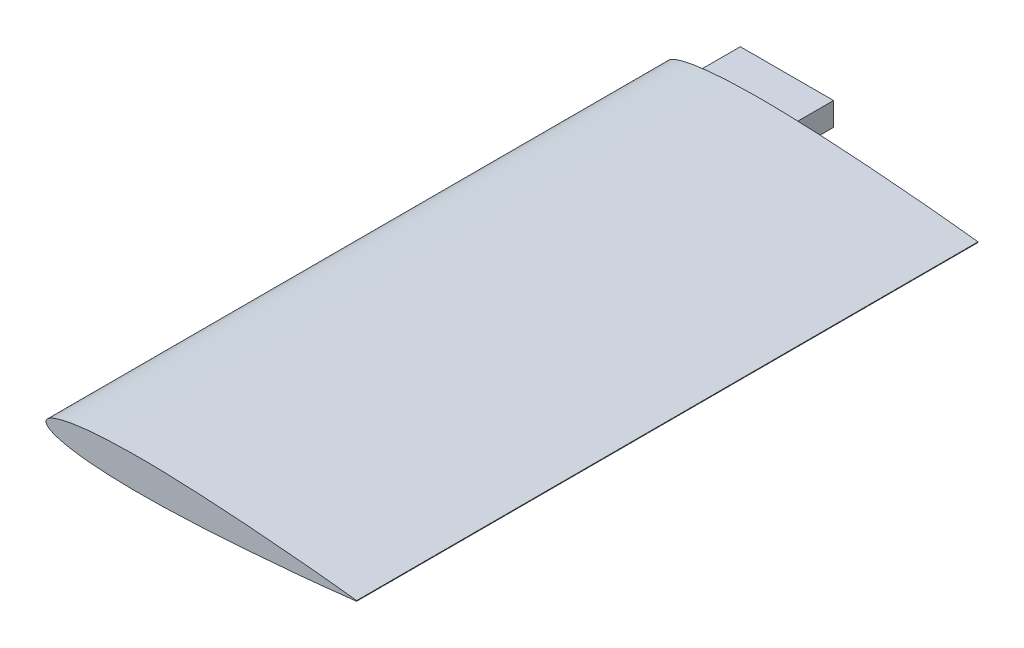
ISO-10303-21;
HEADER;
FILE_DESCRIPTION(('STEP AP214'),'2;1');
FILE_NAME('part.step','',(''),(''),'','','');
FILE_SCHEMA(('AUTOMOTIVE_DESIGN { 1 0 10303 214 1 1 1 1 }'));
ENDSEC;
DATA;
#1=APPLICATION_CONTEXT('core data for automotive mechanical design processes');
#2=APPLICATION_PROTOCOL_DEFINITION('international standard','automotive_design',2000,#1);
#3=PRODUCT_CONTEXT('',#1,'mechanical');
#4=PRODUCT('Part','Part','',(#3));
#5=PRODUCT_RELATED_PRODUCT_CATEGORY('part','',(#4));
#6=PRODUCT_DEFINITION_FORMATION('','',#4);
#7=PRODUCT_DEFINITION_CONTEXT('part definition',#1,'design');
#8=PRODUCT_DEFINITION('design','',#6,#7);
#9=PRODUCT_DEFINITION_SHAPE('','',#8);
#10=(LENGTH_UNIT() NAMED_UNIT(*) SI_UNIT(.MILLI.,.METRE.));
#11=(NAMED_UNIT(*) PLANE_ANGLE_UNIT() SI_UNIT($,.RADIAN.));
#12=(NAMED_UNIT(*) SI_UNIT($,.STERADIAN.) SOLID_ANGLE_UNIT());
#13=UNCERTAINTY_MEASURE_WITH_UNIT(LENGTH_MEASURE(1.E-05),#10,'distance_accuracy_value','');
#14=(GEOMETRIC_REPRESENTATION_CONTEXT(3) GLOBAL_UNCERTAINTY_ASSIGNED_CONTEXT((#13)) GLOBAL_UNIT_ASSIGNED_CONTEXT((#10,
#11,#12)) REPRESENTATION_CONTEXT('',''));
#15=CARTESIAN_POINT('',(0.,0.,0.));
#16=DIRECTION('',(0.,0.,1.));
#17=DIRECTION('',(1.,0.,0.));
#18=AXIS2_PLACEMENT_3D('',#15,#16,#17);
#19=CARTESIAN_POINT('',(40.1321242567515,0.0535132591243339,76.2));
#20=CARTESIAN_POINT('',(40.1279418105788,0.0540050721144117,76.2));
#21=CARTESIAN_POINT('',(40.1112306810011,0.0559701304238156,76.2));
#22=CARTESIAN_POINT('',(40.0736500018208,0.0603077694182548,76.2));
#23=CARTESIAN_POINT('',(40.0110703708323,0.0676571969514773,76.2));
#24=CARTESIAN_POINT('',(39.9235418389783,0.0778500160790829,76.2));
#25=CARTESIAN_POINT('',(39.8111541599803,0.0908957827580396,76.2));
#26=CARTESIAN_POINT('',(39.6740134947025,0.106800014944156,76.2));
#27=CARTESIAN_POINT('',(39.5122696334025,0.125489705283019,76.2));
#28=CARTESIAN_POINT('',(39.326052008163,0.146861496618066,76.2));
#29=CARTESIAN_POINT('',(39.1155709032029,0.170925875928625,76.2));
#30=CARTESIAN_POINT('',(38.8810179946178,0.197663416361273,76.2));
#31=CARTESIAN_POINT('',(38.6226275821043,0.226832706619644,76.2));
#32=CARTESIAN_POINT('',(38.3406749949409,0.258537197320393,76.2));
#33=CARTESIAN_POINT('',(38.0354368307757,0.292609945815936,76.2));
#34=CARTESIAN_POINT('',(37.7071840307129,0.328965573786818,76.2));
#35=CARTESIAN_POINT('',(37.3562624930981,0.367568214027175,76.2));
#36=CARTESIAN_POINT('',(36.9830035756714,0.408250517254515,76.2));
#37=CARTESIAN_POINT('',(36.587790786723,0.450870894472311,76.2));
#38=CARTESIAN_POINT('',(36.1710239241677,0.495565525508571,76.2));
#39=CARTESIAN_POINT('',(35.7330703446121,0.541884830508245,76.2));
#40=CARTESIAN_POINT('',(35.2744157429119,0.5899763151425,76.2));
#41=CARTESIAN_POINT('',(34.7954986183052,0.639725376074922,76.2));
#42=CARTESIAN_POINT('',(34.2967751994489,0.690839822605708,76.2));
#43=CARTESIAN_POINT('',(33.7787145508828,0.743330728829342,76.2));
#44=CARTESIAN_POINT('',(33.2418710797798,0.797207444460088,76.2));
#45=CARTESIAN_POINT('',(32.6867547460175,0.852047913760495,76.2));
#46=CARTESIAN_POINT('',(32.1139436448372,0.908065938360405,76.2));
#47=CARTESIAN_POINT('',(31.5239610615497,0.964829907969942,76.2));
#48=CARTESIAN_POINT('',(30.9174205414204,1.02258034996911,76.2));
#49=CARTESIAN_POINT('',(30.2948930377771,1.08082656422309,76.2));
#50=CARTESIAN_POINT('',(29.6570219518069,1.13977524035605,76.2));
#51=CARTESIAN_POINT('',(29.004390809288,1.19906129287884,76.2));
#52=CARTESIAN_POINT('',(28.3376945314625,1.25874030326226,76.2));
#53=CARTESIAN_POINT('',(27.6575702384295,1.31862610858959,76.2));
#54=CARTESIAN_POINT('',(26.9646919851027,1.37854457465211,76.2));
#55=CARTESIAN_POINT('',(26.2597400034809,1.43840919419539,76.2));
#56=CARTESIAN_POINT('',(25.5434124542922,1.49814917729009,76.2));
#57=CARTESIAN_POINT('',(24.8164129624148,1.55755498997334,76.2));
#58=CARTESIAN_POINT('',(24.0794595530179,1.61657403866187,76.2));
#59=CARTESIAN_POINT('',(23.3332777452138,1.67504069757509,76.2));
#60=CARTESIAN_POINT('',(22.5786257333917,1.73276874566306,76.2));
#61=CARTESIAN_POINT('',(21.8162218953056,1.78971692888558,76.2));
#62=CARTESIAN_POINT('',(21.046840240567,1.84568618796407,76.2));
#63=CARTESIAN_POINT('',(20.2712084549513,1.90053260368886,76.2));
#64=CARTESIAN_POINT('',(19.4901089900151,1.95417086234081,76.2));
#65=CARTESIAN_POINT('',(18.7043206182456,2.00645040641639,76.2));
#66=CARTESIAN_POINT('',(17.9146000739347,2.05713873486335,76.2));
#67=CARTESIAN_POINT('',(17.1217459164428,2.1061363071151,76.2));
#68=CARTESIAN_POINT('',(16.3265273676357,2.15341725133557,76.2));
#69=CARTESIAN_POINT('',(15.5297440018734,2.19860638147546,76.2));
#70=CARTESIAN_POINT('',(14.7321842807355,2.24169620537655,76.2));
#71=CARTESIAN_POINT('',(13.9346236148725,2.28249179202487,76.2));
#72=CARTESIAN_POINT('',(13.1378418921401,2.32086093551415,76.2));
#73=CARTESIAN_POINT('',(12.3426155447534,2.3566094256444,76.2));
#74=CARTESIAN_POINT('',(11.5497643761831,2.38974081095151,76.2));
#75=CARTESIAN_POINT('',(10.7600377543389,2.41981778532476,76.2));
#76=CARTESIAN_POINT('',(9.97424744165448,2.44708366581708,76.2));
#77=CARTESIAN_POINT('',(9.19313934567928,2.47097534206958,76.2));
#78=CARTESIAN_POINT('',(8.41750418608583,2.49169597173862,76.2));
#79=CARTESIAN_POINT('',(7.64811567965739,2.50898985337273,76.2));
#80=CARTESIAN_POINT('',(6.88570301655792,2.52275829295624,76.2));
#81=CARTESIAN_POINT('',(6.13104339467506,2.53275444423582,76.2));
#82=CARTESIAN_POINT('',(5.38485105204477,2.53913164680119,76.2));
#83=CARTESIAN_POINT('',(4.64788512553625,2.54153799464248,76.2));
#84=CARTESIAN_POINT('',(3.92087514141403,2.54000731250512,76.2));
#85=CARTESIAN_POINT('',(3.20453219589683,2.53445020872994,76.2));
#86=CARTESIAN_POINT('',(2.49956553103827,2.52488481958942,76.2));
#87=CARTESIAN_POINT('',(1.80667307590379,2.51103486604574,76.2));
#88=CARTESIAN_POINT('',(1.12652852955934,2.49306760487807,76.2));
#89=CARTESIAN_POINT('',(0.459809878985288,2.47088592607632,76.2));
#90=CARTESIAN_POINT('',(-0.192838445901487,2.44443382966969,76.2));
#91=CARTESIAN_POINT('',(-0.830738428269239,2.41370818746878,76.2));
#92=CARTESIAN_POINT('',(-1.45328379873764,2.37878688734276,76.2));
#93=CARTESIAN_POINT('',(-2.05986417382781,2.33965635630447,76.2));
#94=CARTESIAN_POINT('',(-2.64986914419755,2.29631645942534,76.2));
#95=CARTESIAN_POINT('',(-3.22271949769868,2.24878538817981,76.2));
#96=CARTESIAN_POINT('',(-3.77786955569188,2.19725198261085,76.2));
#97=CARTESIAN_POINT('',(-4.3147597071102,2.14160909006856,76.2));
#98=CARTESIAN_POINT('',(-4.83286615753457,2.08209956747325,76.2));
#99=CARTESIAN_POINT('',(-5.33163777717199,2.0187267292494,76.2));
#100=CARTESIAN_POINT('',(-5.81062084975922,1.95160118572107,76.2));
#101=CARTESIAN_POINT('',(-6.26933866851263,1.88082151875277,76.2));
#102=CARTESIAN_POINT('',(-6.70736929256317,1.80658674829826,76.2));
#103=CARTESIAN_POINT('',(-7.12423437792924,1.72887793709155,76.2));
#104=CARTESIAN_POINT('',(-7.51954065509877,1.64788477248388,76.2));
#105=CARTESIAN_POINT('',(-7.89292670509431,1.56377392761245,76.2));
#106=CARTESIAN_POINT('',(-8.24400123777592,1.47664693629061,76.2));
#107=CARTESIAN_POINT('',(-8.57242018282951,1.38660576756098,76.2));
#108=CARTESIAN_POINT('',(-8.87788299174352,1.29389098278241,76.2));
#109=CARTESIAN_POINT('',(-9.16011072254911,1.19854663873041,76.2));
#110=CARTESIAN_POINT('',(-9.41882434926777,1.10068145098127,76.2));
#111=CARTESIAN_POINT('',(-9.65381471632782,1.000471331635,76.2));
#112=CARTESIAN_POINT('',(-9.86484204596546,0.897997360188644,76.2));
#113=CARTESIAN_POINT('',(-10.0517333555882,0.793330779378764,76.2));
#114=CARTESIAN_POINT('',(-10.2144396307485,0.686687292838309,76.2));
#115=CARTESIAN_POINT('',(-10.3527397509045,0.577857279629728,76.2));
#116=CARTESIAN_POINT('',(-10.4665950669418,0.466915986358584,76.2));
#117=CARTESIAN_POINT('',(-10.5558891163278,0.35374488731564,76.2));
#118=CARTESIAN_POINT('',(-10.6202773458401,0.238098542259817,76.2));
#119=CARTESIAN_POINT('',(-10.6592143401123,0.119945635455643,76.2));
#120=CARTESIAN_POINT('',(-10.6721398921472,0.000173259124337126,76.2));
#121=CARTESIAN_POINT('',(-10.6592143401123,-0.119599117206975,76.2));
#122=CARTESIAN_POINT('',(-10.6202773458401,-0.237752024011159,76.2));
#123=CARTESIAN_POINT('',(-10.5558891163278,-0.353398369066962,76.2));
#124=CARTESIAN_POINT('',(-10.4665950669418,-0.466569468109921,76.2));
#125=CARTESIAN_POINT('',(-10.3527397509045,-0.57751076138106,76.2));
#126=CARTESIAN_POINT('',(-10.2144396307485,-0.686340774589639,76.2));
#127=CARTESIAN_POINT('',(-10.0517333555882,-0.792984261130103,76.2));
#128=CARTESIAN_POINT('',(-9.86484204596547,-0.89765084193997,76.2));
#129=CARTESIAN_POINT('',(-9.65381471632782,-1.00012481338633,76.2));
#130=CARTESIAN_POINT('',(-9.41882434926777,-1.1003349327326,76.2));
#131=CARTESIAN_POINT('',(-9.16011072254912,-1.19820012048174,76.2));
#132=CARTESIAN_POINT('',(-8.87788299174351,-1.29354446453374,76.2));
#133=CARTESIAN_POINT('',(-8.57242018282952,-1.38625924931231,76.2));
#134=CARTESIAN_POINT('',(-8.24400123777591,-1.47630041804194,76.2));
#135=CARTESIAN_POINT('',(-7.89292670509432,-1.56342740936378,76.2));
#136=CARTESIAN_POINT('',(-7.51954065509876,-1.64753825423521,76.2));
#137=CARTESIAN_POINT('',(-7.12423437792925,-1.72853141884288,76.2));
#138=CARTESIAN_POINT('',(-6.70736929256316,-1.80624023004959,76.2));
#139=CARTESIAN_POINT('',(-6.26933866851263,-1.8804750005041,76.2));
#140=CARTESIAN_POINT('',(-5.81062084975922,-1.9512546674724,76.2));
#141=CARTESIAN_POINT('',(-5.33163777717199,-2.01838021100073,76.2));
#142=CARTESIAN_POINT('',(-4.83286615753458,-2.08175304922458,76.2));
#143=CARTESIAN_POINT('',(-4.31475970711019,-2.14126257181989,76.2));
#144=CARTESIAN_POINT('',(-3.77786955569188,-2.19690546436219,76.2));
#145=CARTESIAN_POINT('',(-3.22271949769869,-2.24843886993114,76.2));
#146=CARTESIAN_POINT('',(-2.64986914419754,-2.29596994117668,76.2));
#147=CARTESIAN_POINT('',(-2.05986417382782,-2.3393098380558,76.2));
#148=CARTESIAN_POINT('',(-1.45328379873763,-2.37844036909409,76.2));
#149=CARTESIAN_POINT('',(-0.830738428269235,-2.41336166922011,76.2));
#150=CARTESIAN_POINT('',(-0.192838445901483,-2.44408731142102,76.2));
#151=CARTESIAN_POINT('',(0.459809878985286,-2.47053940782765,76.2));
#152=CARTESIAN_POINT('',(1.12652852955934,-2.4927210866294,76.2));
#153=CARTESIAN_POINT('',(1.80667307590379,-2.51068834779707,76.2));
#154=CARTESIAN_POINT('',(2.49956553103827,-2.52453830134076,76.2));
#155=CARTESIAN_POINT('',(3.20453219589683,-2.53410369048127,76.2));
#156=CARTESIAN_POINT('',(3.92087514141403,-2.53966079425645,76.2));
#157=CARTESIAN_POINT('',(4.64788512553625,-2.54119147639381,76.2));
#158=CARTESIAN_POINT('',(5.38485105204477,-2.53878512855252,76.2));
#159=CARTESIAN_POINT('',(6.13104339467506,-2.53240792598715,76.2));
#160=CARTESIAN_POINT('',(6.88570301655792,-2.52241177470757,76.2));
#161=CARTESIAN_POINT('',(7.6481156796574,-2.50864333512407,76.2));
#162=CARTESIAN_POINT('',(8.41750418608584,-2.49134945348995,76.2));
#163=CARTESIAN_POINT('',(9.19313934567927,-2.47062882382092,76.2));
#164=CARTESIAN_POINT('',(9.97424744165448,-2.44673714756841,76.2));
#165=CARTESIAN_POINT('',(10.7600377543389,-2.41947126707609,76.2));
#166=CARTESIAN_POINT('',(11.5497643761831,-2.38939429270284,76.2));
#167=CARTESIAN_POINT('',(12.3426155447534,-2.35626290739573,76.2));
#168=CARTESIAN_POINT('',(13.1378418921401,-2.32051441726548,76.2));
#169=CARTESIAN_POINT('',(13.9346236148725,-2.2821452737762,76.2));
#170=CARTESIAN_POINT('',(14.7321842807355,-2.24134968712788,76.2));
#171=CARTESIAN_POINT('',(15.5297440018734,-2.19825986322679,76.2));
#172=CARTESIAN_POINT('',(16.3265273676357,-2.1530707330869,76.2));
#173=CARTESIAN_POINT('',(17.1217459164429,-2.10578978886643,76.2));
#174=CARTESIAN_POINT('',(17.9146000739347,-2.05679221661469,76.2));
#175=CARTESIAN_POINT('',(18.7043206182456,-2.00610388816772,76.2));
#176=CARTESIAN_POINT('',(19.4901089900151,-1.95382434409214,76.2));
#177=CARTESIAN_POINT('',(20.2712084549513,-1.9001860854402,76.2));
#178=CARTESIAN_POINT('',(21.046840240567,-1.8453396697154,76.2));
#179=CARTESIAN_POINT('',(21.8162218953056,-1.78937041063691,76.2));
#180=CARTESIAN_POINT('',(22.5786257333917,-1.73242222741439,76.2));
#181=CARTESIAN_POINT('',(23.3332777452138,-1.67469417932642,76.2));
#182=CARTESIAN_POINT('',(24.0794595530179,-1.61622752041321,76.2));
#183=CARTESIAN_POINT('',(24.8164129624148,-1.55720847172467,76.2));
#184=CARTESIAN_POINT('',(25.5434124542922,-1.49780265904142,76.2));
#185=CARTESIAN_POINT('',(26.2597400034809,-1.43806267594672,76.2));
#186=CARTESIAN_POINT('',(26.9646919851027,-1.37819805640344,76.2));
#187=CARTESIAN_POINT('',(27.6575702384295,-1.31827959034092,76.2));
#188=CARTESIAN_POINT('',(28.3376945314625,-1.25839378501359,76.2));
#189=CARTESIAN_POINT('',(29.004390809288,-1.19871477463017,76.2));
#190=CARTESIAN_POINT('',(29.6570219518069,-1.13942872210738,76.2));
#191=CARTESIAN_POINT('',(30.2948930377771,-1.08048004597442,76.2));
#192=CARTESIAN_POINT('',(30.9174205414204,-1.02223383172044,76.2));
#193=CARTESIAN_POINT('',(31.5239610615497,-0.964483389721274,76.2));
#194=CARTESIAN_POINT('',(32.1139436448372,-0.907719420111737,76.2));
#195=CARTESIAN_POINT('',(32.6867547460175,-0.851701395511828,76.2));
#196=CARTESIAN_POINT('',(33.2418710797798,-0.79686092621142,76.2));
#197=CARTESIAN_POINT('',(33.7787145508828,-0.742984210580674,76.2));
#198=CARTESIAN_POINT('',(34.296775199449,-0.690493304357041,76.2));
#199=CARTESIAN_POINT('',(34.7954986183052,-0.639378857826254,76.2));
#200=CARTESIAN_POINT('',(35.2744157429119,-0.589629796893832,76.2));
#201=CARTESIAN_POINT('',(35.7330703446121,-0.541538312259577,76.2));
#202=CARTESIAN_POINT('',(36.1710239241677,-0.495219007259902,76.2));
#203=CARTESIAN_POINT('',(36.587790786723,-0.450524376223643,76.2));
#204=CARTESIAN_POINT('',(36.9830035756714,-0.407903999005847,76.2));
#205=CARTESIAN_POINT('',(37.3562624930981,-0.367221695778506,76.2));
#206=CARTESIAN_POINT('',(37.7071840307129,-0.328619055538152,76.2));
#207=CARTESIAN_POINT('',(38.0354368307757,-0.292263427567267,76.2));
#208=CARTESIAN_POINT('',(38.3406749949409,-0.258190679071726,76.2));
#209=CARTESIAN_POINT('',(38.6226275821043,-0.226486188370977,76.2));
#210=CARTESIAN_POINT('',(38.8810179946178,-0.197316898112605,76.2));
#211=CARTESIAN_POINT('',(39.1155709032029,-0.170579357679958,76.2));
#212=CARTESIAN_POINT('',(39.326052008163,-0.146514978369398,76.2));
#213=CARTESIAN_POINT('',(39.5122696334024,-0.12514318703435,76.2));
#214=CARTESIAN_POINT('',(39.6740134947025,-0.106453496695489,76.2));
#215=CARTESIAN_POINT('',(39.8111541599803,-0.0905492645093712,76.2));
#216=CARTESIAN_POINT('',(39.9235418389783,-0.0775034978304145,76.2));
#217=CARTESIAN_POINT('',(40.0110703708323,-0.0673106787028109,76.2));
#218=CARTESIAN_POINT('',(40.0736500018208,-0.0599612511695863,76.2));
#219=CARTESIAN_POINT('',(40.1112306810011,-0.0556236121751492,76.2));
#220=CARTESIAN_POINT('',(40.1279418105788,-0.053658553865744,76.2));
#221=CARTESIAN_POINT('',(40.1321242567515,-0.0531667408756661,76.2));
#222=B_SPLINE_CURVE_WITH_KNOTS('',3,(#19,#20,#21,#22,#23,#24,#25,#26,#27,#28,#29,#30,#31,#32,
#33,#34,#35,#36,#37,#38,#39,#40,#41,#42,#43,#44,#45,#46,#47,#48,#49,#50,#51,#52,#53,#54,#55,#56,
#57,#58,#59,#60,#61,#62,#63,#64,#65,#66,#67,#68,#69,#70,#71,#72,#73,#74,#75,#76,#77,#78,#79,#80,
#81,#82,#83,#84,#85,#86,#87,#88,#89,#90,#91,#92,#93,#94,#95,#96,#97,#98,#99,#100,#101,#102,#103,
#104,#105,#106,#107,#108,#109,#110,#111,#112,#113,#114,#115,#116,#117,#118,#119,#120,#121,#122,
#123,#124,#125,#126,#127,#128,#129,#130,#131,#132,#133,#134,#135,#136,#137,#138,#139,#140,#141,
#142,#143,#144,#145,#146,#147,#148,#149,#150,#151,#152,#153,#154,#155,#156,#157,#158,#159,#160,
#161,#162,#163,#164,#165,#166,#167,#168,#169,#170,#171,#172,#173,#174,#175,#176,#177,#178,#179,
#180,#181,#182,#183,#184,#185,#186,#187,#188,#189,#190,#191,#192,#193,#194,#195,#196,#197,#198,
#199,#200,#201,#202,#203,#204,#205,#206,#207,#208,#209,#210,#211,#212,#213,#214,#215,#216,#217,
#218,#219,#220,#221),.UNSPECIFIED.,.F.,.F.,(4,1,1,1,1,1,1,1,1,1,1,1,1,1,1,1,1,1,1,1,1,1,1,1,1,1,
1,1,1,1,1,1,1,1,1,1,1,1,1,1,1,1,1,1,1,1,1,1,1,1,1,1,1,1,1,1,1,1,1,1,1,1,1,1,1,1,1,1,1,1,1,1,1,1,
1,1,1,1,1,1,1,1,1,1,1,1,1,1,1,1,1,1,1,1,1,1,1,1,1,1,1,1,1,1,1,1,1,1,1,1,1,1,1,1,1,1,1,1,1,1,1,1,
1,1,1,1,1,1,1,1,1,1,1,1,1,1,1,1,1,1,1,1,1,1,1,1,1,1,1,1,1,1,1,1,1,1,1,1,1,1,1,1,1,1,1,1,1,1,1,1,
1,1,1,1,1,1,1,1,1,1,1,1,1,1,1,1,1,1,1,1,1,1,1,1,1,1,1,1,1,1,4),(0.,0.000122570507308786,
0.00048973532365806,0.00110106200402247,0.00195649344729355,0.0030545041094015,
0.00439411498243635,0.00597477989813809,0.00779344868462634,0.00984963228517402,
0.0121408268653583,0.0146644178506701,0.0174179579231429,0.020398889469767,0.0236036763688049,
0.0270303070800951,0.0306742136802222,0.0345318633958163,0.0385998295036856,0.0428739336994172,
0.0473497702771596,0.0520223394036802,0.056888012236143,0.0619413525769067,0.0671779040423508,
0.072591544051771,0.0781768862612534,0.0839293335185458,0.0898425177635944,0.0959103284590374,
0.102127379220862,0.108487120588097,0.114983630725241,0.121609427488233,0.12835899555107,
0.135225391766802,0.142201182825331,0.149280369782236,0.156455523184093,0.163719176198334,
0.171064848640563,0.178484135596058,0.185971055321065,0.193517173214291,0.201115568071228,
0.208758796643717,0.216438406103102,0.22414798129968,0.23187914276341,0.239624414332632,
0.247375923198132,0.255126267915569,0.262868056408785,0.270593414492002,0.278294991932661,
0.285964404290064,0.293595346075518,0.301179449231067,0.308709443267105,0.316178517142686,
0.323578401269838,0.330903311741252,0.33814503752322,0.345297336807964,0.352353016219242,
0.359304898803913,0.366147304895831,0.372873117461533,0.379475704068392,0.385949951970654,
0.392288810204805,0.39848671896189,0.404537629244294,0.410436531608853,0.416177965587354,
0.421755987337224,0.427166614207208,0.432405016355602,0.4374657805932,0.44234512402414,
0.447038299591253,0.451542591807005,0.455853834586592,0.459968626751863,0.463884025378794,
0.467597723169667,0.471107723265752,0.474411229633955,0.477508152965533,0.480397557703708,
0.483080057446873,0.485556878562922,0.487830503269212,0.489904702577464,0.491787243593992,
0.49348706824616,0.495019104104399,0.496403631059307,0.497668333190465,0.498852082705105,0.5,
0.501147917294895,0.502331666809536,0.503596368940693,0.504980895895602,0.506512931753841,
0.508212756406008,0.510095297422536,0.512169496730788,0.514443121437078,0.516919942553128,
0.519602442296293,0.522491847034467,0.525588770366046,0.528892276734249,0.532402276830334,
0.536115974621206,0.540031373248137,0.544146165413409,0.548457408192995,0.552961700408748,
0.557654875975861,0.5625342194068,0.567594983644398,0.572833385792793,0.578244012662777,
0.583822034412646,0.589563468391148,0.595462370755707,0.60151328103811,0.607711189795196,
0.614050048029347,0.620524295931608,0.627126882538468,0.63385269510417,0.640695101196087,
0.647646983780759,0.654702663192037,0.661854962476781,0.669096688258748,0.676421598730163,
0.683821482857315,0.691290556732896,0.698820550768934,0.706404653924482,0.714035595709937,
0.72170500806734,0.729406585507999,0.737131943591215,0.744873732084432,0.752624076801869,
0.760375585667369,0.76812085723659,0.775852018700321,0.783561593896899,0.791241203356283,
0.798884431928772,0.80648282678571,0.814028944678936,0.821515864403943,0.828935151359437,
0.836280823801666,0.843544476815908,0.850719630217764,0.85779881717467,0.864774608233199,
0.871641004448931,0.878390572511768,0.88501636927476,0.891512879411904,0.897872620779138,
0.904089671540963,0.910157482236406,0.916070666481455,0.921823113738747,0.92740845594823,
0.93282209595765,0.938058647423094,0.943111987763858,0.94797766059632,0.952650229722841,
0.957126066300583,0.961400170496315,0.965468136604184,0.969325786319778,0.972969692919905,
0.976396323631195,0.979601110530233,0.982582042076857,0.98533558214933,0.987859173134642,
0.990150367714826,0.992206551315374,0.994025220101862,0.995605885017564,0.996945495890599,
0.998043506552707,0.998898937995978,0.999510264676342,0.999877429492691,1.),.UNSPECIFIED.);
#223=DIRECTION('',(0.,0.,-1.));
#224=VECTOR('',#223,1.);
#225=SURFACE_OF_LINEAR_EXTRUSION('',#222,#224);
#226=CARTESIAN_POINT('',(40.1321242567515,0.0535132591243339,-25.4));
#227=CARTESIAN_POINT('',(40.1279418105788,0.0540050721144117,-25.4));
#228=CARTESIAN_POINT('',(40.1112306810011,0.0559701304238156,-25.4));
#229=CARTESIAN_POINT('',(40.0736500018208,0.0603077694182548,-25.4));
#230=CARTESIAN_POINT('',(40.0110703708323,0.0676571969514773,-25.4));
#231=CARTESIAN_POINT('',(39.9235418389783,0.0778500160790829,-25.4));
#232=CARTESIAN_POINT('',(39.8111541599803,0.0908957827580396,-25.4));
#233=CARTESIAN_POINT('',(39.6740134947025,0.106800014944156,-25.4));
#234=CARTESIAN_POINT('',(39.5122696334025,0.125489705283019,-25.4));
#235=CARTESIAN_POINT('',(39.326052008163,0.146861496618066,-25.4));
#236=CARTESIAN_POINT('',(39.1155709032029,0.170925875928625,-25.4));
#237=CARTESIAN_POINT('',(38.8810179946178,0.197663416361273,-25.4));
#238=CARTESIAN_POINT('',(38.6226275821043,0.226832706619644,-25.4));
#239=CARTESIAN_POINT('',(38.3406749949409,0.258537197320393,-25.4));
#240=CARTESIAN_POINT('',(38.0354368307757,0.292609945815936,-25.4));
#241=CARTESIAN_POINT('',(37.7071840307129,0.328965573786818,-25.4));
#242=CARTESIAN_POINT('',(37.3562624930981,0.367568214027175,-25.4));
#243=CARTESIAN_POINT('',(36.9830035756714,0.408250517254515,-25.4));
#244=CARTESIAN_POINT('',(36.587790786723,0.450870894472311,-25.4));
#245=CARTESIAN_POINT('',(36.1710239241677,0.495565525508571,-25.4));
#246=CARTESIAN_POINT('',(35.7330703446121,0.541884830508245,-25.4));
#247=CARTESIAN_POINT('',(35.2744157429119,0.5899763151425,-25.4));
#248=CARTESIAN_POINT('',(34.7954986183052,0.639725376074922,-25.4));
#249=CARTESIAN_POINT('',(34.2967751994489,0.690839822605708,-25.4));
#250=CARTESIAN_POINT('',(33.7787145508828,0.743330728829342,-25.4));
#251=CARTESIAN_POINT('',(33.2418710797798,0.797207444460088,-25.4));
#252=CARTESIAN_POINT('',(32.6867547460175,0.852047913760495,-25.4));
#253=CARTESIAN_POINT('',(32.1139436448372,0.908065938360405,-25.4));
#254=CARTESIAN_POINT('',(31.5239610615497,0.964829907969942,-25.4));
#255=CARTESIAN_POINT('',(30.9174205414204,1.02258034996911,-25.4));
#256=CARTESIAN_POINT('',(30.2948930377771,1.08082656422309,-25.4));
#257=CARTESIAN_POINT('',(29.6570219518069,1.13977524035605,-25.4));
#258=CARTESIAN_POINT('',(29.004390809288,1.19906129287884,-25.4));
#259=CARTESIAN_POINT('',(28.3376945314625,1.25874030326226,-25.4));
#260=CARTESIAN_POINT('',(27.6575702384295,1.31862610858959,-25.4));
#261=CARTESIAN_POINT('',(26.9646919851027,1.37854457465211,-25.4));
#262=CARTESIAN_POINT('',(26.2597400034809,1.43840919419539,-25.4));
#263=CARTESIAN_POINT('',(25.5434124542922,1.49814917729009,-25.4));
#264=CARTESIAN_POINT('',(24.8164129624148,1.55755498997334,-25.4));
#265=CARTESIAN_POINT('',(24.0794595530179,1.61657403866187,-25.4));
#266=CARTESIAN_POINT('',(23.3332777452138,1.67504069757509,-25.4));
#267=CARTESIAN_POINT('',(22.5786257333917,1.73276874566306,-25.4));
#268=CARTESIAN_POINT('',(21.8162218953056,1.78971692888558,-25.4));
#269=CARTESIAN_POINT('',(21.046840240567,1.84568618796407,-25.4));
#270=CARTESIAN_POINT('',(20.2712084549513,1.90053260368886,-25.4));
#271=CARTESIAN_POINT('',(19.4901089900151,1.95417086234081,-25.4));
#272=CARTESIAN_POINT('',(18.7043206182456,2.00645040641639,-25.4));
#273=CARTESIAN_POINT('',(17.9146000739347,2.05713873486335,-25.4));
#274=CARTESIAN_POINT('',(17.1217459164428,2.1061363071151,-25.4));
#275=CARTESIAN_POINT('',(16.3265273676357,2.15341725133557,-25.4));
#276=CARTESIAN_POINT('',(15.5297440018734,2.19860638147546,-25.4));
#277=CARTESIAN_POINT('',(14.7321842807355,2.24169620537655,-25.4));
#278=CARTESIAN_POINT('',(13.9346236148725,2.28249179202487,-25.4));
#279=CARTESIAN_POINT('',(13.1378418921401,2.32086093551415,-25.4));
#280=CARTESIAN_POINT('',(12.3426155447534,2.3566094256444,-25.4));
#281=CARTESIAN_POINT('',(11.5497643761831,2.38974081095151,-25.4));
#282=CARTESIAN_POINT('',(10.7600377543389,2.41981778532476,-25.4));
#283=CARTESIAN_POINT('',(9.97424744165448,2.44708366581708,-25.4));
#284=CARTESIAN_POINT('',(9.19313934567928,2.47097534206958,-25.4));
#285=CARTESIAN_POINT('',(8.41750418608583,2.49169597173862,-25.4));
#286=CARTESIAN_POINT('',(7.64811567965739,2.50898985337273,-25.4));
#287=CARTESIAN_POINT('',(6.88570301655792,2.52275829295624,-25.4));
#288=CARTESIAN_POINT('',(6.13104339467506,2.53275444423582,-25.4));
#289=CARTESIAN_POINT('',(5.38485105204477,2.53913164680119,-25.4));
#290=CARTESIAN_POINT('',(4.64788512553625,2.54153799464248,-25.4));
#291=CARTESIAN_POINT('',(3.92087514141403,2.54000731250512,-25.4));
#292=CARTESIAN_POINT('',(3.20453219589683,2.53445020872994,-25.4));
#293=CARTESIAN_POINT('',(2.49956553103827,2.52488481958942,-25.4));
#294=CARTESIAN_POINT('',(1.80667307590379,2.51103486604574,-25.4));
#295=CARTESIAN_POINT('',(1.12652852955934,2.49306760487807,-25.4));
#296=CARTESIAN_POINT('',(0.459809878985288,2.47088592607632,-25.4));
#297=CARTESIAN_POINT('',(-0.192838445901487,2.44443382966969,-25.4));
#298=CARTESIAN_POINT('',(-0.830738428269239,2.41370818746878,-25.4));
#299=CARTESIAN_POINT('',(-1.45328379873764,2.37878688734276,-25.4));
#300=CARTESIAN_POINT('',(-2.05986417382781,2.33965635630447,-25.4));
#301=CARTESIAN_POINT('',(-2.64986914419755,2.29631645942534,-25.4));
#302=CARTESIAN_POINT('',(-3.22271949769868,2.24878538817981,-25.4));
#303=CARTESIAN_POINT('',(-3.77786955569188,2.19725198261085,-25.4));
#304=CARTESIAN_POINT('',(-4.3147597071102,2.14160909006856,-25.4));
#305=CARTESIAN_POINT('',(-4.83286615753457,2.08209956747325,-25.4));
#306=CARTESIAN_POINT('',(-5.33163777717199,2.0187267292494,-25.4));
#307=CARTESIAN_POINT('',(-5.81062084975922,1.95160118572107,-25.4));
#308=CARTESIAN_POINT('',(-6.26933866851263,1.88082151875277,-25.4));
#309=CARTESIAN_POINT('',(-6.70736929256317,1.80658674829826,-25.4));
#310=CARTESIAN_POINT('',(-7.12423437792924,1.72887793709155,-25.4));
#311=CARTESIAN_POINT('',(-7.51954065509877,1.64788477248388,-25.4));
#312=CARTESIAN_POINT('',(-7.89292670509431,1.56377392761245,-25.4));
#313=CARTESIAN_POINT('',(-8.24400123777592,1.47664693629061,-25.4));
#314=CARTESIAN_POINT('',(-8.57242018282951,1.38660576756098,-25.4));
#315=CARTESIAN_POINT('',(-8.87788299174352,1.29389098278241,-25.4));
#316=CARTESIAN_POINT('',(-9.16011072254911,1.19854663873041,-25.4));
#317=CARTESIAN_POINT('',(-9.41882434926777,1.10068145098127,-25.4));
#318=CARTESIAN_POINT('',(-9.65381471632782,1.000471331635,-25.4));
#319=CARTESIAN_POINT('',(-9.86484204596546,0.897997360188644,-25.4));
#320=CARTESIAN_POINT('',(-10.0517333555882,0.793330779378764,-25.4));
#321=CARTESIAN_POINT('',(-10.2144396307485,0.686687292838309,-25.4));
#322=CARTESIAN_POINT('',(-10.3527397509045,0.577857279629728,-25.4));
#323=CARTESIAN_POINT('',(-10.4665950669418,0.466915986358584,-25.4));
#324=CARTESIAN_POINT('',(-10.5558891163278,0.35374488731564,-25.4));
#325=CARTESIAN_POINT('',(-10.6202773458401,0.238098542259817,-25.4));
#326=CARTESIAN_POINT('',(-10.6592143401123,0.119945635455643,-25.4));
#327=CARTESIAN_POINT('',(-10.6721398921472,0.000173259124337126,-25.4));
#328=CARTESIAN_POINT('',(-10.6592143401123,-0.119599117206975,-25.4));
#329=CARTESIAN_POINT('',(-10.6202773458401,-0.237752024011159,-25.4));
#330=CARTESIAN_POINT('',(-10.5558891163278,-0.353398369066962,-25.4));
#331=CARTESIAN_POINT('',(-10.4665950669418,-0.466569468109921,-25.4));
#332=CARTESIAN_POINT('',(-10.3527397509045,-0.57751076138106,-25.4));
#333=CARTESIAN_POINT('',(-10.2144396307485,-0.686340774589639,-25.4));
#334=CARTESIAN_POINT('',(-10.0517333555882,-0.792984261130103,-25.4));
#335=CARTESIAN_POINT('',(-9.86484204596547,-0.89765084193997,-25.4));
#336=CARTESIAN_POINT('',(-9.65381471632782,-1.00012481338633,-25.4));
#337=CARTESIAN_POINT('',(-9.41882434926777,-1.1003349327326,-25.4));
#338=CARTESIAN_POINT('',(-9.16011072254912,-1.19820012048174,-25.4));
#339=CARTESIAN_POINT('',(-8.87788299174351,-1.29354446453374,-25.4));
#340=CARTESIAN_POINT('',(-8.57242018282952,-1.38625924931231,-25.4));
#341=CARTESIAN_POINT('',(-8.24400123777591,-1.47630041804194,-25.4));
#342=CARTESIAN_POINT('',(-7.89292670509432,-1.56342740936378,-25.4));
#343=CARTESIAN_POINT('',(-7.51954065509876,-1.64753825423521,-25.4));
#344=CARTESIAN_POINT('',(-7.12423437792925,-1.72853141884288,-25.4));
#345=CARTESIAN_POINT('',(-6.70736929256316,-1.80624023004959,-25.4));
#346=CARTESIAN_POINT('',(-6.26933866851263,-1.8804750005041,-25.4));
#347=CARTESIAN_POINT('',(-5.81062084975922,-1.9512546674724,-25.4));
#348=CARTESIAN_POINT('',(-5.33163777717199,-2.01838021100073,-25.4));
#349=CARTESIAN_POINT('',(-4.83286615753458,-2.08175304922458,-25.4));
#350=CARTESIAN_POINT('',(-4.31475970711019,-2.14126257181989,-25.4));
#351=CARTESIAN_POINT('',(-3.77786955569188,-2.19690546436219,-25.4));
#352=CARTESIAN_POINT('',(-3.22271949769869,-2.24843886993114,-25.4));
#353=CARTESIAN_POINT('',(-2.64986914419754,-2.29596994117668,-25.4));
#354=CARTESIAN_POINT('',(-2.05986417382782,-2.3393098380558,-25.4));
#355=CARTESIAN_POINT('',(-1.45328379873763,-2.37844036909409,-25.4));
#356=CARTESIAN_POINT('',(-0.830738428269235,-2.41336166922011,-25.4));
#357=CARTESIAN_POINT('',(-0.192838445901483,-2.44408731142102,-25.4));
#358=CARTESIAN_POINT('',(0.459809878985286,-2.47053940782765,-25.4));
#359=CARTESIAN_POINT('',(1.12652852955934,-2.4927210866294,-25.4));
#360=CARTESIAN_POINT('',(1.80667307590379,-2.51068834779707,-25.4));
#361=CARTESIAN_POINT('',(2.49956553103827,-2.52453830134076,-25.4));
#362=CARTESIAN_POINT('',(3.20453219589683,-2.53410369048127,-25.4));
#363=CARTESIAN_POINT('',(3.92087514141403,-2.53966079425645,-25.4));
#364=CARTESIAN_POINT('',(4.64788512553625,-2.54119147639381,-25.4));
#365=CARTESIAN_POINT('',(5.38485105204477,-2.53878512855252,-25.4));
#366=CARTESIAN_POINT('',(6.13104339467506,-2.53240792598715,-25.4));
#367=CARTESIAN_POINT('',(6.88570301655792,-2.52241177470757,-25.4));
#368=CARTESIAN_POINT('',(7.6481156796574,-2.50864333512407,-25.4));
#369=CARTESIAN_POINT('',(8.41750418608584,-2.49134945348995,-25.4));
#370=CARTESIAN_POINT('',(9.19313934567927,-2.47062882382092,-25.4));
#371=CARTESIAN_POINT('',(9.97424744165448,-2.44673714756841,-25.4));
#372=CARTESIAN_POINT('',(10.7600377543389,-2.41947126707609,-25.4));
#373=CARTESIAN_POINT('',(11.5497643761831,-2.38939429270284,-25.4));
#374=CARTESIAN_POINT('',(12.3426155447534,-2.35626290739573,-25.4));
#375=CARTESIAN_POINT('',(13.1378418921401,-2.32051441726548,-25.4));
#376=CARTESIAN_POINT('',(13.9346236148725,-2.2821452737762,-25.4));
#377=CARTESIAN_POINT('',(14.7321842807355,-2.24134968712788,-25.4));
#378=CARTESIAN_POINT('',(15.5297440018734,-2.19825986322679,-25.4));
#379=CARTESIAN_POINT('',(16.3265273676357,-2.1530707330869,-25.4));
#380=CARTESIAN_POINT('',(17.1217459164429,-2.10578978886643,-25.4));
#381=CARTESIAN_POINT('',(17.9146000739347,-2.05679221661469,-25.4));
#382=CARTESIAN_POINT('',(18.7043206182456,-2.00610388816772,-25.4));
#383=CARTESIAN_POINT('',(19.4901089900151,-1.95382434409214,-25.4));
#384=CARTESIAN_POINT('',(20.2712084549513,-1.9001860854402,-25.4));
#385=CARTESIAN_POINT('',(21.046840240567,-1.8453396697154,-25.4));
#386=CARTESIAN_POINT('',(21.8162218953056,-1.78937041063691,-25.4));
#387=CARTESIAN_POINT('',(22.5786257333917,-1.73242222741439,-25.4));
#388=CARTESIAN_POINT('',(23.3332777452138,-1.67469417932642,-25.4));
#389=CARTESIAN_POINT('',(24.0794595530179,-1.61622752041321,-25.4));
#390=CARTESIAN_POINT('',(24.8164129624148,-1.55720847172467,-25.4));
#391=CARTESIAN_POINT('',(25.5434124542922,-1.49780265904142,-25.4));
#392=CARTESIAN_POINT('',(26.2597400034809,-1.43806267594672,-25.4));
#393=CARTESIAN_POINT('',(26.9646919851027,-1.37819805640344,-25.4));
#394=CARTESIAN_POINT('',(27.6575702384295,-1.31827959034092,-25.4));
#395=CARTESIAN_POINT('',(28.3376945314625,-1.25839378501359,-25.4));
#396=CARTESIAN_POINT('',(29.004390809288,-1.19871477463017,-25.4));
#397=CARTESIAN_POINT('',(29.6570219518069,-1.13942872210738,-25.4));
#398=CARTESIAN_POINT('',(30.2948930377771,-1.08048004597442,-25.4));
#399=CARTESIAN_POINT('',(30.9174205414204,-1.02223383172044,-25.4));
#400=CARTESIAN_POINT('',(31.5239610615497,-0.964483389721274,-25.4));
#401=CARTESIAN_POINT('',(32.1139436448372,-0.907719420111737,-25.4));
#402=CARTESIAN_POINT('',(32.6867547460175,-0.851701395511828,-25.4));
#403=CARTESIAN_POINT('',(33.2418710797798,-0.79686092621142,-25.4));
#404=CARTESIAN_POINT('',(33.7787145508828,-0.742984210580674,-25.4));
#405=CARTESIAN_POINT('',(34.296775199449,-0.690493304357041,-25.4));
#406=CARTESIAN_POINT('',(34.7954986183052,-0.639378857826254,-25.4));
#407=CARTESIAN_POINT('',(35.2744157429119,-0.589629796893832,-25.4));
#408=CARTESIAN_POINT('',(35.7330703446121,-0.541538312259577,-25.4));
#409=CARTESIAN_POINT('',(36.1710239241677,-0.495219007259902,-25.4));
#410=CARTESIAN_POINT('',(36.587790786723,-0.450524376223643,-25.4));
#411=CARTESIAN_POINT('',(36.9830035756714,-0.407903999005847,-25.4));
#412=CARTESIAN_POINT('',(37.3562624930981,-0.367221695778506,-25.4));
#413=CARTESIAN_POINT('',(37.7071840307129,-0.328619055538152,-25.4));
#414=CARTESIAN_POINT('',(38.0354368307757,-0.292263427567267,-25.4));
#415=CARTESIAN_POINT('',(38.3406749949409,-0.258190679071726,-25.4));
#416=CARTESIAN_POINT('',(38.6226275821043,-0.226486188370977,-25.4));
#417=CARTESIAN_POINT('',(38.8810179946178,-0.197316898112605,-25.4));
#418=CARTESIAN_POINT('',(39.1155709032029,-0.170579357679958,-25.4));
#419=CARTESIAN_POINT('',(39.326052008163,-0.146514978369398,-25.4));
#420=CARTESIAN_POINT('',(39.5122696334024,-0.12514318703435,-25.4));
#421=CARTESIAN_POINT('',(39.6740134947025,-0.106453496695489,-25.4));
#422=CARTESIAN_POINT('',(39.8111541599803,-0.0905492645093712,-25.4));
#423=CARTESIAN_POINT('',(39.9235418389783,-0.0775034978304145,-25.4));
#424=CARTESIAN_POINT('',(40.0110703708323,-0.0673106787028109,-25.4));
#425=CARTESIAN_POINT('',(40.0736500018208,-0.0599612511695863,-25.4));
#426=CARTESIAN_POINT('',(40.1112306810011,-0.0556236121751492,-25.4));
#427=CARTESIAN_POINT('',(40.1279418105788,-0.053658553865744,-25.4));
#428=CARTESIAN_POINT('',(40.1321242567515,-0.0531667408756661,-25.4));
#429=B_SPLINE_CURVE_WITH_KNOTS('',3,(#226,#227,#228,#229,#230,#231,#232,#233,#234,#235,#236,
#237,#238,#239,#240,#241,#242,#243,#244,#245,#246,#247,#248,#249,#250,#251,#252,#253,#254,#255,
#256,#257,#258,#259,#260,#261,#262,#263,#264,#265,#266,#267,#268,#269,#270,#271,#272,#273,#274,
#275,#276,#277,#278,#279,#280,#281,#282,#283,#284,#285,#286,#287,#288,#289,#290,#291,#292,#293,
#294,#295,#296,#297,#298,#299,#300,#301,#302,#303,#304,#305,#306,#307,#308,#309,#310,#311,#312,
#313,#314,#315,#316,#317,#318,#319,#320,#321,#322,#323,#324,#325,#326,#327,#328,#329,#330,#331,
#332,#333,#334,#335,#336,#337,#338,#339,#340,#341,#342,#343,#344,#345,#346,#347,#348,#349,#350,
#351,#352,#353,#354,#355,#356,#357,#358,#359,#360,#361,#362,#363,#364,#365,#366,#367,#368,#369,
#370,#371,#372,#373,#374,#375,#376,#377,#378,#379,#380,#381,#382,#383,#384,#385,#386,#387,#388,
#389,#390,#391,#392,#393,#394,#395,#396,#397,#398,#399,#400,#401,#402,#403,#404,#405,#406,#407,
#408,#409,#410,#411,#412,#413,#414,#415,#416,#417,#418,#419,#420,#421,#422,#423,#424,#425,#426,
#427,#428),.UNSPECIFIED.,.F.,.F.,(4,1,1,1,1,1,1,1,1,1,1,1,1,1,1,1,1,1,1,1,1,1,1,1,1,1,1,1,1,1,1,
1,1,1,1,1,1,1,1,1,1,1,1,1,1,1,1,1,1,1,1,1,1,1,1,1,1,1,1,1,1,1,1,1,1,1,1,1,1,1,1,1,1,1,1,1,1,1,1,
1,1,1,1,1,1,1,1,1,1,1,1,1,1,1,1,1,1,1,1,1,1,1,1,1,1,1,1,1,1,1,1,1,1,1,1,1,1,1,1,1,1,1,1,1,1,1,1,
1,1,1,1,1,1,1,1,1,1,1,1,1,1,1,1,1,1,1,1,1,1,1,1,1,1,1,1,1,1,1,1,1,1,1,1,1,1,1,1,1,1,1,1,1,1,1,1,
1,1,1,1,1,1,1,1,1,1,1,1,1,1,1,1,1,1,1,1,1,1,1,1,1,4),(0.,0.000122570507308786,
0.00048973532365806,0.00110106200402247,0.00195649344729355,0.0030545041094015,
0.00439411498243635,0.00597477989813809,0.00779344868462634,0.00984963228517402,
0.0121408268653583,0.0146644178506701,0.0174179579231429,0.020398889469767,0.0236036763688049,
0.0270303070800951,0.0306742136802222,0.0345318633958163,0.0385998295036856,0.0428739336994172,
0.0473497702771596,0.0520223394036802,0.056888012236143,0.0619413525769067,0.0671779040423508,
0.072591544051771,0.0781768862612534,0.0839293335185458,0.0898425177635944,0.0959103284590374,
0.102127379220862,0.108487120588097,0.114983630725241,0.121609427488233,0.12835899555107,
0.135225391766802,0.142201182825331,0.149280369782236,0.156455523184093,0.163719176198334,
0.171064848640563,0.178484135596058,0.185971055321065,0.193517173214291,0.201115568071228,
0.208758796643717,0.216438406103102,0.22414798129968,0.23187914276341,0.239624414332632,
0.247375923198132,0.255126267915569,0.262868056408785,0.270593414492002,0.278294991932661,
0.285964404290064,0.293595346075518,0.301179449231067,0.308709443267105,0.316178517142686,
0.323578401269838,0.330903311741252,0.33814503752322,0.345297336807964,0.352353016219242,
0.359304898803913,0.366147304895831,0.372873117461533,0.379475704068392,0.385949951970654,
0.392288810204805,0.39848671896189,0.404537629244294,0.410436531608853,0.416177965587354,
0.421755987337224,0.427166614207208,0.432405016355602,0.4374657805932,0.44234512402414,
0.447038299591253,0.451542591807005,0.455853834586592,0.459968626751863,0.463884025378794,
0.467597723169667,0.471107723265752,0.474411229633955,0.477508152965533,0.480397557703708,
0.483080057446873,0.485556878562922,0.487830503269212,0.489904702577464,0.491787243593992,
0.49348706824616,0.495019104104399,0.496403631059307,0.497668333190465,0.498852082705105,0.5,
0.501147917294895,0.502331666809536,0.503596368940693,0.504980895895602,0.506512931753841,
0.508212756406008,0.510095297422536,0.512169496730788,0.514443121437078,0.516919942553128,
0.519602442296293,0.522491847034467,0.525588770366046,0.528892276734249,0.532402276830334,
0.536115974621206,0.540031373248137,0.544146165413409,0.548457408192995,0.552961700408748,
0.557654875975861,0.5625342194068,0.567594983644398,0.572833385792793,0.578244012662777,
0.583822034412646,0.589563468391148,0.595462370755707,0.60151328103811,0.607711189795196,
0.614050048029347,0.620524295931608,0.627126882538468,0.63385269510417,0.640695101196087,
0.647646983780759,0.654702663192037,0.661854962476781,0.669096688258748,0.676421598730163,
0.683821482857315,0.691290556732896,0.698820550768934,0.706404653924482,0.714035595709937,
0.72170500806734,0.729406585507999,0.737131943591215,0.744873732084432,0.752624076801869,
0.760375585667369,0.76812085723659,0.775852018700321,0.783561593896899,0.791241203356283,
0.798884431928772,0.80648282678571,0.814028944678936,0.821515864403943,0.828935151359437,
0.836280823801666,0.843544476815908,0.850719630217764,0.85779881717467,0.864774608233199,
0.871641004448931,0.878390572511768,0.88501636927476,0.891512879411904,0.897872620779138,
0.904089671540963,0.910157482236406,0.916070666481455,0.921823113738747,0.92740845594823,
0.93282209595765,0.938058647423094,0.943111987763858,0.94797766059632,0.952650229722841,
0.957126066300583,0.961400170496315,0.965468136604184,0.969325786319778,0.972969692919905,
0.976396323631195,0.979601110530233,0.982582042076857,0.98533558214933,0.987859173134642,
0.990150367714826,0.992206551315374,0.994025220101862,0.995605885017564,0.996945495890599,
0.998043506552707,0.998898937995978,0.999510264676342,0.999877429492691,1.),.UNSPECIFIED.);
#430=CARTESIAN_POINT('',(40.1321242567515,0.0535132591243339,-25.4));
#431=VERTEX_POINT('',#430);
#432=CARTESIAN_POINT('',(40.1321242567515,-0.0531667408756661,-25.4));
#433=VERTEX_POINT('',#432);
#434=EDGE_CURVE('E122',#431,#433,#429,.T.);
#435=ORIENTED_EDGE('',*,*,#434,.T.);
#436=DIRECTION('',(0.,0.,-1.));
#437=VECTOR('',#436,1.);
#438=CARTESIAN_POINT('',(40.1321242567515,-0.0531667408756661,76.2));
#439=LINE('',#438,#437);
#440=CARTESIAN_POINT('',(40.1321242567515,-0.0531667408756661,76.2));
#441=VERTEX_POINT('',#440);
#442=EDGE_CURVE('E11',#441,#433,#439,.T.);
#443=ORIENTED_EDGE('',*,*,#442,.F.);
#444=CARTESIAN_POINT('',(40.1321242567515,0.0535132591243339,76.2));
#445=VERTEX_POINT('',#444);
#446=EDGE_CURVE('E125',#445,#441,#222,.T.);
#447=ORIENTED_EDGE('',*,*,#446,.F.);
#448=DIRECTION('',(0.,0.,-1.));
#449=VECTOR('',#448,1.);
#450=CARTESIAN_POINT('',(40.1321242567515,0.0535132591243339,76.2));
#451=LINE('',#450,#449);
#452=EDGE_CURVE('E45',#445,#431,#451,.T.);
#453=ORIENTED_EDGE('',*,*,#452,.T.);
#454=EDGE_LOOP('',(#435,#443,#447,#453));
#455=FACE_BOUND('',#454,.T.);
#456=ADVANCED_FACE('F37',(#455),#225,.F.);
#457=CARTESIAN_POINT('',(40.1321242567515,0.0535132591243339,76.2));
#458=DIRECTION('',(1.,0.,0.));
#459=DIRECTION('',(0.,0.,-1.));
#460=AXIS2_PLACEMENT_3D('',#457,#458,#459);
#461=PLANE('',#460);
#462=DIRECTION('',(0.,-1.,0.));
#463=VECTOR('',#462,1.);
#464=CARTESIAN_POINT('',(40.1321242567515,0.0535132591243339,-25.4));
#465=LINE('',#464,#463);
#466=EDGE_CURVE('E131',#431,#433,#465,.T.);
#467=ORIENTED_EDGE('',*,*,#466,.F.);
#468=ORIENTED_EDGE('',*,*,#452,.F.);
#469=DIRECTION('',(0.,-1.,0.));
#470=VECTOR('',#469,1.);
#471=CARTESIAN_POINT('',(40.1321242567515,0.0535132591243339,76.2));
#472=LINE('',#471,#470);
#473=EDGE_CURVE('E130',#445,#441,#472,.T.);
#474=ORIENTED_EDGE('',*,*,#473,.T.);
#475=ORIENTED_EDGE('',*,*,#442,.T.);
#476=EDGE_LOOP('',(#467,#468,#474,#475));
#477=FACE_BOUND('',#476,.T.);
#478=ADVANCED_FACE('F154',(#477),#461,.T.);
#479=CARTESIAN_POINT('',(-10.6678757432485,0.000173259124368279,76.2));
#480=DIRECTION('',(0.,0.,-1.));
#481=DIRECTION('',(-1.,0.,0.));
#482=AXIS2_PLACEMENT_3D('',#479,#480,#481);
#483=PLANE('',#482);
#484=ORIENTED_EDGE('',*,*,#446,.T.);
#485=ORIENTED_EDGE('',*,*,#473,.F.);
#486=EDGE_LOOP('',(#484,#485));
#487=FACE_BOUND('',#486,.T.);
#488=ADVANCED_FACE('F156',(#487),#483,.F.);
#489=CARTESIAN_POINT('',(-10.6678757432485,0.000173259124368279,-25.4));
#490=DIRECTION('',(0.,0.,-1.));
#491=DIRECTION('',(-1.,0.,0.));
#492=AXIS2_PLACEMENT_3D('',#489,#490,#491);
#493=PLANE('',#492);
#494=DIRECTION('',(-1.,0.,0.));
#495=VECTOR('',#494,1.);
#496=CARTESIAN_POINT('',(10.16,1.905,-25.4));
#497=LINE('',#496,#495);
#498=CARTESIAN_POINT('',(10.16,1.905,-25.4));
#499=VERTEX_POINT('',#498);
#500=CARTESIAN_POINT('',(-5.08,1.905,-25.4));
#501=VERTEX_POINT('',#500);
#502=EDGE_CURVE('E112',#499,#501,#497,.T.);
#503=ORIENTED_EDGE('',*,*,#502,.T.);
#504=DIRECTION('',(0.,-1.,0.));
#505=VECTOR('',#504,1.);
#506=CARTESIAN_POINT('',(-5.08,1.905,-25.4));
#507=LINE('',#506,#505);
#508=CARTESIAN_POINT('',(-5.08,-1.905,-25.4));
#509=VERTEX_POINT('',#508);
#510=EDGE_CURVE('E94',#501,#509,#507,.T.);
#511=ORIENTED_EDGE('',*,*,#510,.T.);
#512=DIRECTION('',(1.,0.,0.));
#513=VECTOR('',#512,1.);
#514=CARTESIAN_POINT('',(5.08,-1.905,-25.4));
#515=LINE('',#514,#513);
#516=CARTESIAN_POINT('',(10.16,-1.905,-25.4));
#517=VERTEX_POINT('',#516);
#518=EDGE_CURVE('E57',#509,#517,#515,.T.);
#519=ORIENTED_EDGE('',*,*,#518,.T.);
#520=DIRECTION('',(0.,1.,0.));
#521=VECTOR('',#520,1.);
#522=CARTESIAN_POINT('',(10.16,-1.905,-25.4));
#523=LINE('',#522,#521);
#524=EDGE_CURVE('E52',#517,#499,#523,.T.);
#525=ORIENTED_EDGE('',*,*,#524,.T.);
#526=EDGE_LOOP('',(#503,#511,#519,#525));
#527=FACE_BOUND('',#526,.T.);
#528=ORIENTED_EDGE('',*,*,#434,.F.);
#529=ORIENTED_EDGE('',*,*,#466,.T.);
#530=EDGE_LOOP('',(#528,#529));
#531=FACE_BOUND('',#530,.T.);
#532=ADVANCED_FACE('F153',(#527,#531),#493,.T.);
#533=CARTESIAN_POINT('',(10.16,1.905,-31.75));
#534=DIRECTION('',(0.,1.,0.));
#535=DIRECTION('',(0.,0.,1.));
#536=AXIS2_PLACEMENT_3D('',#533,#534,#535);
#537=PLANE('',#536);
#538=ORIENTED_EDGE('',*,*,#502,.F.);
#539=DIRECTION('',(0.,0.,1.));
#540=VECTOR('',#539,1.);
#541=CARTESIAN_POINT('',(10.16,1.905,-31.75));
#542=LINE('',#541,#540);
#543=CARTESIAN_POINT('',(10.16,1.905,-31.75));
#544=VERTEX_POINT('',#543);
#545=EDGE_CURVE('E110',#544,#499,#542,.T.);
#546=ORIENTED_EDGE('',*,*,#545,.F.);
#547=DIRECTION('',(-1.,0.,0.));
#548=VECTOR('',#547,1.);
#549=CARTESIAN_POINT('',(5.08,1.905,-31.75));
#550=LINE('',#549,#548);
#551=CARTESIAN_POINT('',(-5.08,1.905,-31.75));
#552=VERTEX_POINT('',#551);
#553=EDGE_CURVE('E104',#544,#552,#550,.T.);
#554=ORIENTED_EDGE('',*,*,#553,.T.);
#555=DIRECTION('',(0.,0.,1.));
#556=VECTOR('',#555,1.);
#557=CARTESIAN_POINT('',(-5.08,1.905,-31.75));
#558=LINE('',#557,#556);
#559=EDGE_CURVE('E89',#552,#501,#558,.T.);
#560=ORIENTED_EDGE('',*,*,#559,.T.);
#561=EDGE_LOOP('',(#538,#546,#554,#560));
#562=FACE_BOUND('',#561,.T.);
#563=ADVANCED_FACE('F109',(#562),#537,.T.);
#564=CARTESIAN_POINT('',(10.16,-1.905,-31.75));
#565=DIRECTION('',(1.,0.,0.));
#566=DIRECTION('',(0.,0.,-1.));
#567=AXIS2_PLACEMENT_3D('',#564,#565,#566);
#568=PLANE('',#567);
#569=ORIENTED_EDGE('',*,*,#524,.F.);
#570=DIRECTION('',(0.,0.,1.));
#571=VECTOR('',#570,1.);
#572=CARTESIAN_POINT('',(10.16,-1.905,-31.75));
#573=LINE('',#572,#571);
#574=CARTESIAN_POINT('',(10.16,-1.905,-31.75));
#575=VERTEX_POINT('',#574);
#576=EDGE_CURVE('E123',#575,#517,#573,.T.);
#577=ORIENTED_EDGE('',*,*,#576,.F.);
#578=DIRECTION('',(0.,1.,0.));
#579=VECTOR('',#578,1.);
#580=CARTESIAN_POINT('',(10.16,-1.905,-31.75));
#581=LINE('',#580,#579);
#582=EDGE_CURVE('E99',#575,#544,#581,.T.);
#583=ORIENTED_EDGE('',*,*,#582,.T.);
#584=ORIENTED_EDGE('',*,*,#545,.T.);
#585=EDGE_LOOP('',(#569,#577,#583,#584));
#586=FACE_BOUND('',#585,.T.);
#587=ADVANCED_FACE('F192',(#586),#568,.T.);
#588=CARTESIAN_POINT('',(5.08,-1.905,-31.75));
#589=DIRECTION('',(0.,-1.,0.));
#590=DIRECTION('',(1.,0.,0.));
#591=AXIS2_PLACEMENT_3D('',#588,#589,#590);
#592=PLANE('',#591);
#593=ORIENTED_EDGE('',*,*,#518,.F.);
#594=DIRECTION('',(0.,0.,1.));
#595=VECTOR('',#594,1.);
#596=CARTESIAN_POINT('',(-5.08,-1.905,-31.75));
#597=LINE('',#596,#595);
#598=CARTESIAN_POINT('',(-5.08,-1.905,-31.75));
#599=VERTEX_POINT('',#598);
#600=EDGE_CURVE('E98',#599,#509,#597,.T.);
#601=ORIENTED_EDGE('',*,*,#600,.F.);
#602=DIRECTION('',(-1.,0.,0.));
#603=VECTOR('',#602,1.);
#604=CARTESIAN_POINT('',(5.08,-1.905,-31.75));
#605=LINE('',#604,#603);
#606=EDGE_CURVE('E106',#575,#599,#605,.T.);
#607=ORIENTED_EDGE('',*,*,#606,.F.);
#608=ORIENTED_EDGE('',*,*,#576,.T.);
#609=EDGE_LOOP('',(#593,#601,#607,#608));
#610=FACE_BOUND('',#609,.T.);
#611=ADVANCED_FACE('F201',(#610),#592,.T.);
#612=CARTESIAN_POINT('',(-5.08,1.905,-31.75));
#613=DIRECTION('',(-1.,0.,0.));
#614=DIRECTION('',(0.,0.,1.));
#615=AXIS2_PLACEMENT_3D('',#612,#613,#614);
#616=PLANE('',#615);
#617=ORIENTED_EDGE('',*,*,#510,.F.);
#618=ORIENTED_EDGE('',*,*,#559,.F.);
#619=DIRECTION('',(0.,-1.,0.));
#620=VECTOR('',#619,1.);
#621=CARTESIAN_POINT('',(-5.08,1.905,-31.75));
#622=LINE('',#621,#620);
#623=EDGE_CURVE('E93',#552,#599,#622,.T.);
#624=ORIENTED_EDGE('',*,*,#623,.T.);
#625=ORIENTED_EDGE('',*,*,#600,.T.);
#626=EDGE_LOOP('',(#617,#618,#624,#625));
#627=FACE_BOUND('',#626,.T.);
#628=ADVANCED_FACE('F91',(#627),#616,.T.);
#629=CARTESIAN_POINT('',(0.,0.,-31.75));
#630=DIRECTION('',(0.,0.,1.));
#631=DIRECTION('',(1.,0.,0.));
#632=AXIS2_PLACEMENT_3D('',#629,#630,#631);
#633=PLANE('',#632);
#634=ORIENTED_EDGE('',*,*,#553,.F.);
#635=ORIENTED_EDGE('',*,*,#582,.F.);
#636=ORIENTED_EDGE('',*,*,#606,.T.);
#637=ORIENTED_EDGE('',*,*,#623,.F.);
#638=EDGE_LOOP('',(#634,#635,#636,#637));
#639=FACE_BOUND('',#638,.T.);
#640=ADVANCED_FACE('F102',(#639),#633,.F.);
#641=CLOSED_SHELL('',(#456,#478,#488,#532,#563,#587,#611,#628,#640));
#642=MANIFOLD_SOLID_BREP('B2',#641);
#643=ADVANCED_BREP_SHAPE_REPRESENTATION('',(#18,#642),#14);
#644=SHAPE_DEFINITION_REPRESENTATION(#9,#643);
ENDSEC;
END-ISO-10303-21;
